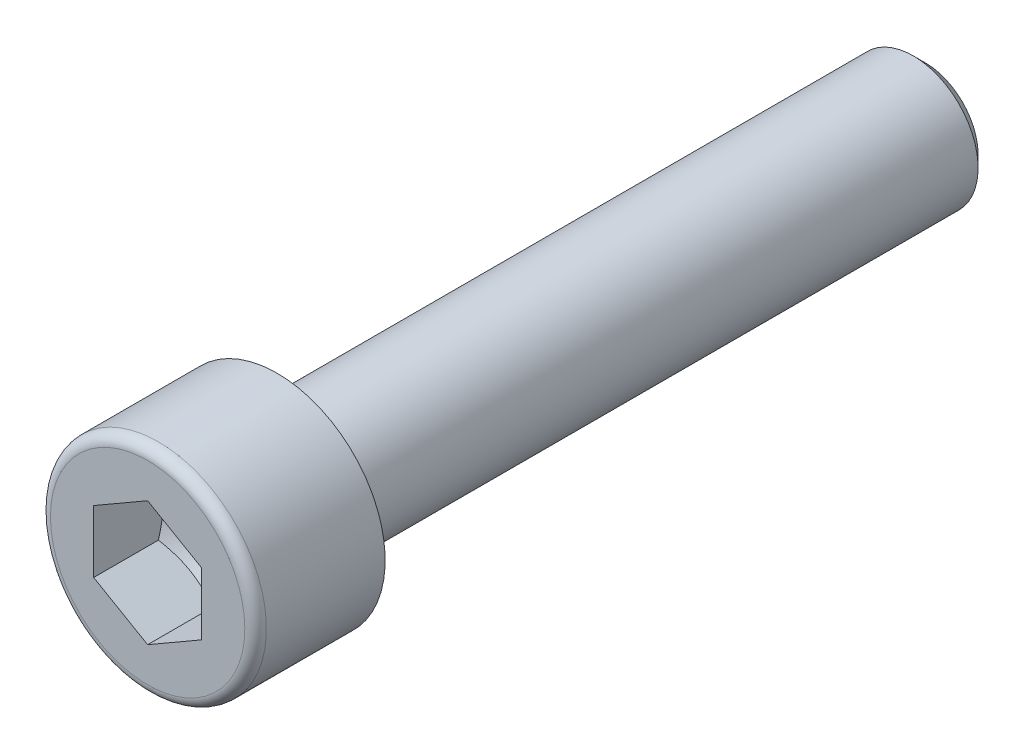
ISO-10303-21;
HEADER;
FILE_DESCRIPTION(('STEP AP214'),'2;1');
FILE_NAME('part.step','',(''),(''),'','','');
FILE_SCHEMA(('AUTOMOTIVE_DESIGN { 1 0 10303 214 1 1 1 1 }'));
ENDSEC;
DATA;
#1=APPLICATION_CONTEXT('core data for automotive mechanical design processes');
#2=APPLICATION_PROTOCOL_DEFINITION('international standard','automotive_design',2000,#1);
#3=PRODUCT_CONTEXT('',#1,'mechanical');
#4=PRODUCT('Part','Part','',(#3));
#5=PRODUCT_RELATED_PRODUCT_CATEGORY('part','',(#4));
#6=PRODUCT_DEFINITION_FORMATION('','',#4);
#7=PRODUCT_DEFINITION_CONTEXT('part definition',#1,'design');
#8=PRODUCT_DEFINITION('design','',#6,#7);
#9=PRODUCT_DEFINITION_SHAPE('','',#8);
#10=(LENGTH_UNIT() NAMED_UNIT(*) SI_UNIT(.MILLI.,.METRE.));
#11=(NAMED_UNIT(*) PLANE_ANGLE_UNIT() SI_UNIT($,.RADIAN.));
#12=(NAMED_UNIT(*) SI_UNIT($,.STERADIAN.) SOLID_ANGLE_UNIT());
#13=UNCERTAINTY_MEASURE_WITH_UNIT(LENGTH_MEASURE(1.E-05),#10,'distance_accuracy_value','');
#14=(GEOMETRIC_REPRESENTATION_CONTEXT(3) GLOBAL_UNCERTAINTY_ASSIGNED_CONTEXT((#13)) GLOBAL_UNIT_ASSIGNED_CONTEXT((#10,
#11,#12)) REPRESENTATION_CONTEXT('',''));
#15=CARTESIAN_POINT('',(0.,0.,0.));
#16=DIRECTION('',(0.,0.,1.));
#17=DIRECTION('',(1.,0.,0.));
#18=AXIS2_PLACEMENT_3D('',#15,#16,#17);
#19=CARTESIAN_POINT('',(-2.5,0.,0.));
#20=DIRECTION('',(0.,0.,-1.));
#21=DIRECTION('',(-1.,0.,0.));
#22=AXIS2_PLACEMENT_3D('',#19,#20,#21);
#23=PLANE('',#22);
#24=CARTESIAN_POINT('',(0.,0.,0.));
#25=DIRECTION('',(0.,0.,-1.));
#26=DIRECTION('',(-1.,0.,0.));
#27=AXIS2_PLACEMENT_3D('',#24,#25,#26);
#28=CIRCLE('',#27,5.);
#29=CARTESIAN_POINT('',(-5.,0.,0.));
#30=VERTEX_POINT('',#29);
#31=EDGE_CURVE('E11',#30,#30,#28,.T.);
#32=ORIENTED_EDGE('',*,*,#31,.T.);
#33=EDGE_LOOP('',(#32));
#34=FACE_BOUND('',#33,.T.);
#35=CARTESIAN_POINT('',(0.,0.,0.));
#36=DIRECTION('',(0.,0.,1.));
#37=DIRECTION('',(-1.,0.,0.));
#38=AXIS2_PLACEMENT_3D('',#35,#36,#37);
#39=CIRCLE('',#38,3.);
#40=CARTESIAN_POINT('',(3.,0.,0.));
#41=VERTEX_POINT('',#40);
#42=EDGE_CURVE('E130',#41,#41,#39,.T.);
#43=ORIENTED_EDGE('',*,*,#42,.T.);
#44=EDGE_LOOP('',(#43));
#45=FACE_BOUND('',#44,.T.);
#46=ADVANCED_FACE('F16',(#34,#45),#23,.T.);
#47=CARTESIAN_POINT('',(0.,0.,2.75));
#48=DIRECTION('',(0.,0.,1.));
#49=DIRECTION('',(-1.,0.,0.));
#50=AXIS2_PLACEMENT_3D('',#47,#48,#49);
#51=CYLINDRICAL_SURFACE('',#50,5.);
#52=CARTESIAN_POINT('',(0.,0.,5.5));
#53=DIRECTION('',(0.,0.,-1.));
#54=DIRECTION('',(-1.,0.,0.));
#55=AXIS2_PLACEMENT_3D('',#52,#53,#54);
#56=CIRCLE('',#55,5.);
#57=CARTESIAN_POINT('',(-5.,0.,5.5));
#58=VERTEX_POINT('',#57);
#59=EDGE_CURVE('E25',#58,#58,#56,.T.);
#60=ORIENTED_EDGE('',*,*,#59,.T.);
#61=EDGE_LOOP('',(#60));
#62=FACE_BOUND('',#61,.T.);
#63=ORIENTED_EDGE('',*,*,#31,.F.);
#64=EDGE_LOOP('',(#63));
#65=FACE_BOUND('',#64,.T.);
#66=ADVANCED_FACE('F205',(#62,#65),#51,.T.);
#67=CARTESIAN_POINT('',(0.,0.,5.5));
#68=DIRECTION('',(0.,0.,-1.));
#69=DIRECTION('',(0.,-1.,0.));
#70=AXIS2_PLACEMENT_3D('',#67,#68,#69);
#71=TOROIDAL_SURFACE('',#70,4.5,0.5);
#72=CARTESIAN_POINT('',(0.,0.,6.));
#73=DIRECTION('',(0.,0.,-1.));
#74=DIRECTION('',(-1.,0.,0.));
#75=AXIS2_PLACEMENT_3D('',#72,#73,#74);
#76=CIRCLE('',#75,4.5);
#77=CARTESIAN_POINT('',(-4.5,0.,6.));
#78=VERTEX_POINT('',#77);
#79=EDGE_CURVE('E141',#78,#78,#76,.T.);
#80=ORIENTED_EDGE('',*,*,#79,.T.);
#81=EDGE_LOOP('',(#80));
#82=FACE_BOUND('',#81,.T.);
#83=ORIENTED_EDGE('',*,*,#59,.F.);
#84=EDGE_LOOP('',(#83));
#85=FACE_BOUND('',#84,.T.);
#86=ADVANCED_FACE('F209',(#82,#85),#71,.T.);
#87=CARTESIAN_POINT('',(-2.25,0.,6.));
#88=DIRECTION('',(0.,0.,1.));
#89=DIRECTION('',(1.,0.,0.));
#90=AXIS2_PLACEMENT_3D('',#87,#88,#89);
#91=PLANE('',#90);
#92=ORIENTED_EDGE('',*,*,#79,.F.);
#93=EDGE_LOOP('',(#92));
#94=FACE_BOUND('',#93,.T.);
#95=DIRECTION('',(-0.866025403784439,-0.5,0.));
#96=VECTOR('',#95,1.);
#97=CARTESIAN_POINT('',(0.406249417187364,-2.65220178962874,6.));
#98=LINE('',#97,#96);
#99=CARTESIAN_POINT('',(2.49999883437473,-1.443375,6.));
#100=VERTEX_POINT('',#99);
#101=CARTESIAN_POINT('',(0.,-2.88675,6.));
#102=VERTEX_POINT('',#101);
#103=EDGE_CURVE('E147',#100,#102,#98,.T.);
#104=ORIENTED_EDGE('',*,*,#103,.T.);
#105=DIRECTION('',(-0.866025403784439,0.5,0.));
#106=VECTOR('',#105,1.);
#107=CARTESIAN_POINT('',(-2.09374941718736,-1.67792321037125,6.));
#108=LINE('',#107,#106);
#109=CARTESIAN_POINT('',(-2.49999883437473,-1.443375,6.));
#110=VERTEX_POINT('',#109);
#111=EDGE_CURVE('E131',#102,#110,#108,.T.);
#112=ORIENTED_EDGE('',*,*,#111,.T.);
#113=DIRECTION('',(0.,1.,0.));
#114=VECTOR('',#113,1.);
#115=CARTESIAN_POINT('',(-2.49999883437473,0.,6.));
#116=LINE('',#115,#114);
#117=CARTESIAN_POINT('',(-2.49999883437473,1.443375,6.));
#118=VERTEX_POINT('',#117);
#119=EDGE_CURVE('E144',#110,#118,#116,.T.);
#120=ORIENTED_EDGE('',*,*,#119,.T.);
#121=DIRECTION('',(0.866025403784439,0.5,0.));
#122=VECTOR('',#121,1.);
#123=CARTESIAN_POINT('',(-2.09374941718736,1.67792321037125,6.));
#124=LINE('',#123,#122);
#125=CARTESIAN_POINT('',(0.,2.88675,6.));
#126=VERTEX_POINT('',#125);
#127=EDGE_CURVE('E132',#118,#126,#124,.T.);
#128=ORIENTED_EDGE('',*,*,#127,.T.);
#129=DIRECTION('',(0.866025403784439,-0.5,0.));
#130=VECTOR('',#129,1.);
#131=CARTESIAN_POINT('',(0.406249417187364,2.65220178962874,6.));
#132=LINE('',#131,#130);
#133=CARTESIAN_POINT('',(2.49999883437473,1.443375,6.));
#134=VERTEX_POINT('',#133);
#135=EDGE_CURVE('E96',#126,#134,#132,.T.);
#136=ORIENTED_EDGE('',*,*,#135,.T.);
#137=DIRECTION('',(0.,-1.,0.));
#138=VECTOR('',#137,1.);
#139=CARTESIAN_POINT('',(2.49999883437473,0.,6.));
#140=LINE('',#139,#138);
#141=EDGE_CURVE('E93',#134,#100,#140,.T.);
#142=ORIENTED_EDGE('',*,*,#141,.T.);
#143=EDGE_LOOP('',(#104,#112,#120,#128,#136,#142));
#144=FACE_BOUND('',#143,.T.);
#145=ADVANCED_FACE('F179',(#94,#144),#91,.T.);
#146=CARTESIAN_POINT('',(-1.229375,0.,-30.));
#147=DIRECTION('',(0.,0.,-1.));
#148=DIRECTION('',(-1.,0.,0.));
#149=AXIS2_PLACEMENT_3D('',#146,#147,#148);
#150=PLANE('',#149);
#151=CARTESIAN_POINT('',(0.,0.,-30.));
#152=DIRECTION('',(0.,0.,-1.));
#153=DIRECTION('',(-1.,0.,0.));
#154=AXIS2_PLACEMENT_3D('',#151,#152,#153);
#155=CIRCLE('',#154,2.45875);
#156=CARTESIAN_POINT('',(-2.45875,0.,-30.));
#157=VERTEX_POINT('',#156);
#158=EDGE_CURVE('E148',#157,#157,#155,.T.);
#159=ORIENTED_EDGE('',*,*,#158,.T.);
#160=EDGE_LOOP('',(#159));
#161=FACE_BOUND('',#160,.T.);
#162=ADVANCED_FACE('F228',(#161),#150,.T.);
#163=CARTESIAN_POINT('',(0.,0.,-29.729375));
#164=DIRECTION('',(0.,0.,1.));
#165=DIRECTION('',(-1.,0.,0.));
#166=AXIS2_PLACEMENT_3D('',#163,#164,#165);
#167=CONICAL_SURFACE('',#166,2.729375,0.78539816339745);
#168=CARTESIAN_POINT('',(0.,0.,-29.45875));
#169=DIRECTION('',(0.,0.,-1.));
#170=DIRECTION('',(-1.,0.,0.));
#171=AXIS2_PLACEMENT_3D('',#168,#169,#170);
#172=CIRCLE('',#171,3.);
#173=CARTESIAN_POINT('',(-3.,0.,-29.45875));
#174=VERTEX_POINT('',#173);
#175=EDGE_CURVE('E124',#174,#174,#172,.T.);
#176=ORIENTED_EDGE('',*,*,#175,.T.);
#177=EDGE_LOOP('',(#176));
#178=FACE_BOUND('',#177,.T.);
#179=ORIENTED_EDGE('',*,*,#158,.F.);
#180=EDGE_LOOP('',(#179));
#181=FACE_BOUND('',#180,.T.);
#182=ADVANCED_FACE('F221',(#178,#181),#167,.T.);
#183=CARTESIAN_POINT('',(0.,0.,-14.229375));
#184=DIRECTION('',(0.,0.,1.));
#185=DIRECTION('',(-1.,0.,0.));
#186=AXIS2_PLACEMENT_3D('',#183,#184,#185);
#187=CYLINDRICAL_SURFACE('',#186,3.);
#188=ORIENTED_EDGE('',*,*,#42,.F.);
#189=EDGE_LOOP('',(#188));
#190=FACE_BOUND('',#189,.T.);
#191=ORIENTED_EDGE('',*,*,#175,.F.);
#192=EDGE_LOOP('',(#191));
#193=FACE_BOUND('',#192,.T.);
#194=ADVANCED_FACE('F219',(#190,#193),#187,.T.);
#195=CARTESIAN_POINT('',(-1.24999941718736,-2.1650625,6.));
#196=DIRECTION('',(-0.5,-0.866025403784439,0.));
#197=DIRECTION('',(-0.866025403784439,0.5,0.));
#198=AXIS2_PLACEMENT_3D('',#195,#196,#197);
#199=PLANE('',#198);
#200=CARTESIAN_POINT('',(0.,-2.88675,3.));
#201=CARTESIAN_POINT('',(-1.24999941718736,-2.1650625,2.58333352760422));
#202=CARTESIAN_POINT('',(-2.49999883437473,-1.443375,3.));
#203=(BOUNDED_CURVE() B_SPLINE_CURVE(2,(#200,#201,#202),.UNSPECIFIED.,.F.,
.F.) B_SPLINE_CURVE_WITH_KNOTS((3,3),(0.,2.92108898323611),
.UNSPECIFIED.) CURVE() GEOMETRIC_REPRESENTATION_ITEM() RATIONAL_B_SPLINE_CURVE((1.,
1.15470053837925,1.)) REPRESENTATION_ITEM(''));
#204=CARTESIAN_POINT('',(0.,-2.88675,3.));
#205=VERTEX_POINT('',#204);
#206=CARTESIAN_POINT('',(-2.49999883437473,-1.443375,3.));
#207=VERTEX_POINT('',#206);
#208=EDGE_CURVE('E111',#205,#207,#203,.T.);
#209=ORIENTED_EDGE('',*,*,#208,.T.);
#210=DIRECTION('',(0.,0.,-1.));
#211=VECTOR('',#210,1.);
#212=CARTESIAN_POINT('',(-2.49999883437473,-1.443375,6.));
#213=LINE('',#212,#211);
#214=EDGE_CURVE('E142',#110,#207,#213,.T.);
#215=ORIENTED_EDGE('',*,*,#214,.F.);
#216=ORIENTED_EDGE('',*,*,#111,.F.);
#217=DIRECTION('',(0.,0.,-1.));
#218=VECTOR('',#217,1.);
#219=CARTESIAN_POINT('',(0.,-2.88675,6.));
#220=LINE('',#219,#218);
#221=EDGE_CURVE('E106',#102,#205,#220,.T.);
#222=ORIENTED_EDGE('',*,*,#221,.T.);
#223=EDGE_LOOP('',(#209,#215,#216,#222));
#224=FACE_BOUND('',#223,.T.);
#225=ADVANCED_FACE('F183',(#224),#199,.F.);
#226=CARTESIAN_POINT('',(-2.49999883437473,0.,6.));
#227=DIRECTION('',(-1.,0.,0.));
#228=DIRECTION('',(0.,1.,0.));
#229=AXIS2_PLACEMENT_3D('',#226,#227,#228);
#230=PLANE('',#229);
#231=CARTESIAN_POINT('',(-2.49999883437473,-1.443375,3.));
#232=CARTESIAN_POINT('',(-2.49999883437473,0.,2.58333352760421));
#233=CARTESIAN_POINT('',(-2.49999883437473,1.443375,3.));
#234=(BOUNDED_CURVE() B_SPLINE_CURVE(2,(#231,#232,#233),.UNSPECIFIED.,.F.,
.F.) B_SPLINE_CURVE_WITH_KNOTS((3,3),(0.,2.92108898323611),
.UNSPECIFIED.) CURVE() GEOMETRIC_REPRESENTATION_ITEM() RATIONAL_B_SPLINE_CURVE((1.,
1.15470053837925,1.)) REPRESENTATION_ITEM(''));
#235=CARTESIAN_POINT('',(-2.49999883437473,1.443375,3.));
#236=VERTEX_POINT('',#235);
#237=EDGE_CURVE('E123',#207,#236,#234,.T.);
#238=ORIENTED_EDGE('',*,*,#237,.T.);
#239=DIRECTION('',(0.,0.,-1.));
#240=VECTOR('',#239,1.);
#241=CARTESIAN_POINT('',(-2.49999883437473,1.443375,6.));
#242=LINE('',#241,#240);
#243=EDGE_CURVE('E133',#118,#236,#242,.T.);
#244=ORIENTED_EDGE('',*,*,#243,.F.);
#245=ORIENTED_EDGE('',*,*,#119,.F.);
#246=ORIENTED_EDGE('',*,*,#214,.T.);
#247=EDGE_LOOP('',(#238,#244,#245,#246));
#248=FACE_BOUND('',#247,.T.);
#249=ADVANCED_FACE('F190',(#248),#230,.F.);
#250=CARTESIAN_POINT('',(-1.24999941718736,2.1650625,6.));
#251=DIRECTION('',(-0.5,0.866025403784439,0.));
#252=DIRECTION('',(0.866025403784439,0.5,0.));
#253=AXIS2_PLACEMENT_3D('',#250,#251,#252);
#254=PLANE('',#253);
#255=CARTESIAN_POINT('',(-2.49999883437473,1.443375,3.));
#256=CARTESIAN_POINT('',(-1.24999941718736,2.1650625,2.58333352760421));
#257=CARTESIAN_POINT('',(0.,2.88675,3.));
#258=(BOUNDED_CURVE() B_SPLINE_CURVE(2,(#255,#256,#257),.UNSPECIFIED.,.F.,
.F.) B_SPLINE_CURVE_WITH_KNOTS((3,3),(0.,2.9210889832361),
.UNSPECIFIED.) CURVE() GEOMETRIC_REPRESENTATION_ITEM() RATIONAL_B_SPLINE_CURVE((1.,
1.15470053837926,1.)) REPRESENTATION_ITEM(''));
#259=CARTESIAN_POINT('',(0.,2.88675,3.));
#260=VERTEX_POINT('',#259);
#261=EDGE_CURVE('E119',#236,#260,#258,.T.);
#262=ORIENTED_EDGE('',*,*,#261,.T.);
#263=DIRECTION('',(0.,0.,-1.));
#264=VECTOR('',#263,1.);
#265=CARTESIAN_POINT('',(0.,2.88675,6.));
#266=LINE('',#265,#264);
#267=EDGE_CURVE('E102',#126,#260,#266,.T.);
#268=ORIENTED_EDGE('',*,*,#267,.F.);
#269=ORIENTED_EDGE('',*,*,#127,.F.);
#270=ORIENTED_EDGE('',*,*,#243,.T.);
#271=EDGE_LOOP('',(#262,#268,#269,#270));
#272=FACE_BOUND('',#271,.T.);
#273=ADVANCED_FACE('F192',(#272),#254,.F.);
#274=CARTESIAN_POINT('',(1.24999941718736,2.1650625,6.));
#275=DIRECTION('',(0.5,0.866025403784439,0.));
#276=DIRECTION('',(0.866025403784439,-0.5,0.));
#277=AXIS2_PLACEMENT_3D('',#274,#275,#276);
#278=PLANE('',#277);
#279=CARTESIAN_POINT('',(0.,2.88675,3.));
#280=CARTESIAN_POINT('',(1.24999941718736,2.1650625,2.58333352760421));
#281=CARTESIAN_POINT('',(2.49999883437473,1.443375,3.));
#282=(BOUNDED_CURVE() B_SPLINE_CURVE(2,(#279,#280,#281),.UNSPECIFIED.,.F.,
.F.) B_SPLINE_CURVE_WITH_KNOTS((3,3),(0.,2.9210889832361),
.UNSPECIFIED.) CURVE() GEOMETRIC_REPRESENTATION_ITEM() RATIONAL_B_SPLINE_CURVE((1.,
1.15470053837926,1.)) REPRESENTATION_ITEM(''));
#283=CARTESIAN_POINT('',(2.49999883437473,1.443375,3.));
#284=VERTEX_POINT('',#283);
#285=EDGE_CURVE('E99',#260,#284,#282,.T.);
#286=ORIENTED_EDGE('',*,*,#285,.T.);
#287=DIRECTION('',(0.,0.,-1.));
#288=VECTOR('',#287,1.);
#289=CARTESIAN_POINT('',(2.49999883437473,1.443375,6.));
#290=LINE('',#289,#288);
#291=EDGE_CURVE('E87',#134,#284,#290,.T.);
#292=ORIENTED_EDGE('',*,*,#291,.F.);
#293=ORIENTED_EDGE('',*,*,#135,.F.);
#294=ORIENTED_EDGE('',*,*,#267,.T.);
#295=EDGE_LOOP('',(#286,#292,#293,#294));
#296=FACE_BOUND('',#295,.T.);
#297=ADVANCED_FACE('F100',(#296),#278,.F.);
#298=CARTESIAN_POINT('',(2.49999883437473,0.,6.));
#299=DIRECTION('',(1.,0.,0.));
#300=DIRECTION('',(0.,-1.,0.));
#301=AXIS2_PLACEMENT_3D('',#298,#299,#300);
#302=PLANE('',#301);
#303=CARTESIAN_POINT('',(2.49999883437473,1.443375,3.));
#304=CARTESIAN_POINT('',(2.49999883437473,0.,2.58333352760421));
#305=CARTESIAN_POINT('',(2.49999883437473,-1.443375,3.));
#306=(BOUNDED_CURVE() B_SPLINE_CURVE(2,(#303,#304,#305),.UNSPECIFIED.,.F.,
.F.) B_SPLINE_CURVE_WITH_KNOTS((3,3),(0.,2.92108898323611),
.UNSPECIFIED.) CURVE() GEOMETRIC_REPRESENTATION_ITEM() RATIONAL_B_SPLINE_CURVE((1.,
1.15470053837925,1.)) REPRESENTATION_ITEM(''));
#307=CARTESIAN_POINT('',(2.49999883437473,-1.443375,3.));
#308=VERTEX_POINT('',#307);
#309=EDGE_CURVE('E90',#284,#308,#306,.T.);
#310=ORIENTED_EDGE('',*,*,#309,.T.);
#311=DIRECTION('',(0.,0.,-1.));
#312=VECTOR('',#311,1.);
#313=CARTESIAN_POINT('',(2.49999883437473,-1.443375,6.));
#314=LINE('',#313,#312);
#315=EDGE_CURVE('E81',#100,#308,#314,.T.);
#316=ORIENTED_EDGE('',*,*,#315,.F.);
#317=ORIENTED_EDGE('',*,*,#141,.F.);
#318=ORIENTED_EDGE('',*,*,#291,.T.);
#319=EDGE_LOOP('',(#310,#316,#317,#318));
#320=FACE_BOUND('',#319,.T.);
#321=ADVANCED_FACE('F18',(#320),#302,.F.);
#322=CARTESIAN_POINT('',(1.24999941718736,-2.1650625,6.));
#323=DIRECTION('',(0.5,-0.866025403784439,0.));
#324=DIRECTION('',(-0.866025403784439,-0.5,0.));
#325=AXIS2_PLACEMENT_3D('',#322,#323,#324);
#326=PLANE('',#325);
#327=CARTESIAN_POINT('',(2.49999883437473,-1.443375,3.));
#328=CARTESIAN_POINT('',(1.24999941718737,-2.1650625,2.58333352760422));
#329=CARTESIAN_POINT('',(0.,-2.88675,3.));
#330=(BOUNDED_CURVE() B_SPLINE_CURVE(2,(#327,#328,#329),.UNSPECIFIED.,.F.,
.F.) B_SPLINE_CURVE_WITH_KNOTS((3,3),(0.,2.92108898323611),
.UNSPECIFIED.) CURVE() GEOMETRIC_REPRESENTATION_ITEM() RATIONAL_B_SPLINE_CURVE((1.,
1.15470053837925,1.)) REPRESENTATION_ITEM(''));
#331=EDGE_CURVE('E110',#308,#205,#330,.T.);
#332=ORIENTED_EDGE('',*,*,#331,.T.);
#333=ORIENTED_EDGE('',*,*,#221,.F.);
#334=ORIENTED_EDGE('',*,*,#103,.F.);
#335=ORIENTED_EDGE('',*,*,#315,.T.);
#336=EDGE_LOOP('',(#332,#333,#334,#335));
#337=FACE_BOUND('',#336,.T.);
#338=ADVANCED_FACE('F181',(#337),#326,.F.);
#339=CARTESIAN_POINT('',(0.,0.,2.16666705520842));
#340=DIRECTION('',(0.,0.,1.));
#341=DIRECTION('',(-1.,0.,0.));
#342=AXIS2_PLACEMENT_3D('',#339,#340,#341);
#343=CONICAL_SURFACE('',#342,1.443375,1.0471975511966);
#344=CARTESIAN_POINT('',(0.,0.,1.33333411041685));
#345=VERTEX_POINT('',#344);
#346=VERTEX_LOOP('',#345);
#347=FACE_BOUND('',#346,.T.);
#348=ORIENTED_EDGE('',*,*,#261,.F.);
#349=ORIENTED_EDGE('',*,*,#237,.F.);
#350=ORIENTED_EDGE('',*,*,#208,.F.);
#351=ORIENTED_EDGE('',*,*,#331,.F.);
#352=ORIENTED_EDGE('',*,*,#309,.F.);
#353=ORIENTED_EDGE('',*,*,#285,.F.);
#354=EDGE_LOOP('',(#348,#349,#350,#351,#352,#353));
#355=FACE_BOUND('',#354,.T.);
#356=ADVANCED_FACE('F108',(#347,#355),#343,.F.);
#357=CLOSED_SHELL('',(#46,#66,#86,#145,#162,#182,#194,#225,#249,#273,#297,#321,#338,#356));
#358=MANIFOLD_SOLID_BREP('B1',#357);
#359=ADVANCED_BREP_SHAPE_REPRESENTATION('',(#18,#358),#14);
#360=SHAPE_DEFINITION_REPRESENTATION(#9,#359);
ENDSEC;
END-ISO-10303-21;
